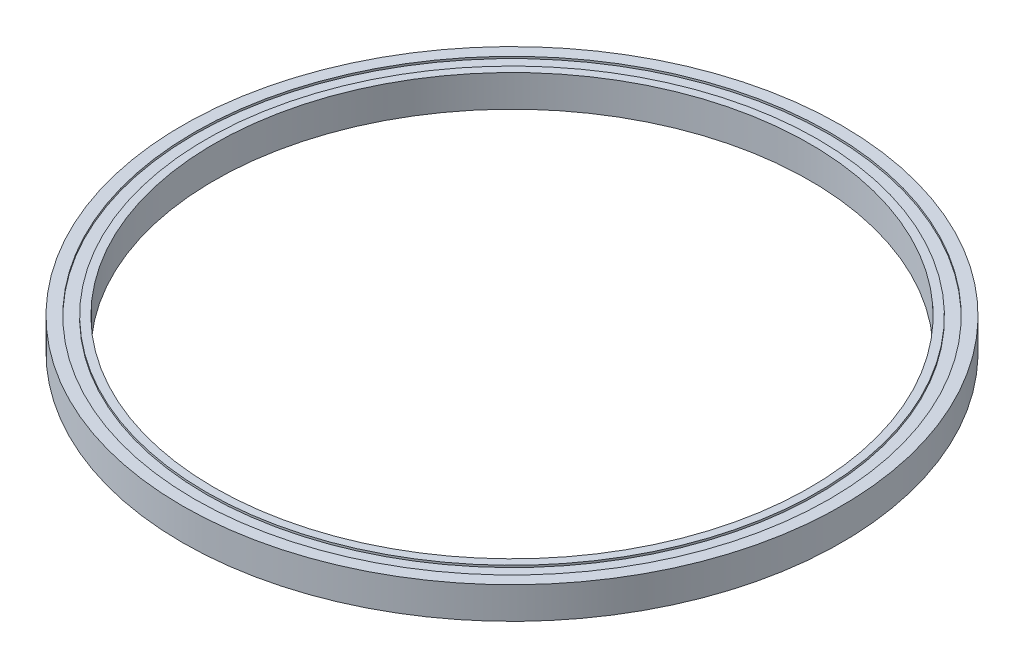
ISO-10303-21;
HEADER;
FILE_DESCRIPTION(('STEP AP214'),'2;1');
FILE_NAME('part.step','',(''),(''),'','','');
FILE_SCHEMA(('AUTOMOTIVE_DESIGN { 1 0 10303 214 1 1 1 1 }'));
ENDSEC;
DATA;
#1=APPLICATION_CONTEXT('core data for automotive mechanical design processes');
#2=APPLICATION_PROTOCOL_DEFINITION('international standard','automotive_design',2000,#1);
#3=PRODUCT_CONTEXT('',#1,'mechanical');
#4=PRODUCT('Part','Part','',(#3));
#5=PRODUCT_RELATED_PRODUCT_CATEGORY('part','',(#4));
#6=PRODUCT_DEFINITION_FORMATION('','',#4);
#7=PRODUCT_DEFINITION_CONTEXT('part definition',#1,'design');
#8=PRODUCT_DEFINITION('design','',#6,#7);
#9=PRODUCT_DEFINITION_SHAPE('','',#8);
#10=(LENGTH_UNIT() NAMED_UNIT(*) SI_UNIT(.MILLI.,.METRE.));
#11=(NAMED_UNIT(*) PLANE_ANGLE_UNIT() SI_UNIT($,.RADIAN.));
#12=(NAMED_UNIT(*) SI_UNIT($,.STERADIAN.) SOLID_ANGLE_UNIT());
#13=UNCERTAINTY_MEASURE_WITH_UNIT(LENGTH_MEASURE(1.E-05),#10,'distance_accuracy_value','');
#14=(GEOMETRIC_REPRESENTATION_CONTEXT(3) GLOBAL_UNCERTAINTY_ASSIGNED_CONTEXT((#13)) GLOBAL_UNIT_ASSIGNED_CONTEXT((#10,
#11,#12)) REPRESENTATION_CONTEXT('',''));
#15=CARTESIAN_POINT('',(0.,0.,0.));
#16=DIRECTION('',(0.,0.,1.));
#17=DIRECTION('',(1.,0.,0.));
#18=AXIS2_PLACEMENT_3D('',#15,#16,#17);
#19=CARTESIAN_POINT('',(0.,0.,0.));
#20=DIRECTION('',(0.,1.,0.));
#21=DIRECTION('',(0.,0.,1.));
#22=AXIS2_PLACEMENT_3D('',#19,#20,#21);
#23=PLANE('',#22);
#24=CARTESIAN_POINT('',(0.,0.,0.));
#25=DIRECTION('',(0.,1.,0.));
#26=DIRECTION('',(0.,0.,1.));
#27=AXIS2_PLACEMENT_3D('',#24,#25,#26);
#28=CIRCLE('',#27,75.);
#29=CARTESIAN_POINT('',(0.,0.,75.));
#30=VERTEX_POINT('',#29);
#31=EDGE_CURVE('E47',#30,#30,#28,.T.);
#32=ORIENTED_EDGE('',*,*,#31,.T.);
#33=EDGE_LOOP('',(#32));
#34=FACE_BOUND('',#33,.T.);
#35=CARTESIAN_POINT('',(0.,0.,0.));
#36=DIRECTION('',(0.,-1.,0.));
#37=DIRECTION('',(0.,0.,-1.));
#38=AXIS2_PLACEMENT_3D('',#35,#36,#37);
#39=CIRCLE('',#38,77.);
#40=CARTESIAN_POINT('',(0.,0.,-77.));
#41=VERTEX_POINT('',#40);
#42=EDGE_CURVE('E71',#41,#41,#39,.T.);
#43=ORIENTED_EDGE('',*,*,#42,.T.);
#44=EDGE_LOOP('',(#43));
#45=FACE_BOUND('',#44,.T.);
#46=ADVANCED_FACE('F34',(#34,#45),#23,.F.);
#47=CARTESIAN_POINT('',(0.,8.,0.));
#48=DIRECTION('',(0.,1.,0.));
#49=DIRECTION('',(0.,0.,1.));
#50=AXIS2_PLACEMENT_3D('',#47,#48,#49);
#51=PLANE('',#50);
#52=CARTESIAN_POINT('',(0.,8.,0.));
#53=DIRECTION('',(0.,1.,0.));
#54=DIRECTION('',(0.,0.,1.));
#55=AXIS2_PLACEMENT_3D('',#52,#53,#54);
#56=CIRCLE('',#55,75.);
#57=CARTESIAN_POINT('',(0.,8.,75.));
#58=VERTEX_POINT('',#57);
#59=EDGE_CURVE('E45',#58,#58,#56,.T.);
#60=ORIENTED_EDGE('',*,*,#59,.F.);
#61=EDGE_LOOP('',(#60));
#62=FACE_BOUND('',#61,.T.);
#63=CARTESIAN_POINT('',(0.,8.,0.));
#64=DIRECTION('',(0.,1.,0.));
#65=DIRECTION('',(0.,0.,1.));
#66=AXIS2_PLACEMENT_3D('',#63,#64,#65);
#67=CIRCLE('',#66,77.);
#68=CARTESIAN_POINT('',(0.,8.,77.));
#69=VERTEX_POINT('',#68);
#70=EDGE_CURVE('E59',#69,#69,#67,.T.);
#71=ORIENTED_EDGE('',*,*,#70,.T.);
#72=EDGE_LOOP('',(#71));
#73=FACE_BOUND('',#72,.T.);
#74=ADVANCED_FACE('F109',(#62,#73),#51,.T.);
#75=CARTESIAN_POINT('',(0.,8.,0.));
#76=DIRECTION('',(0.,1.,0.));
#77=DIRECTION('',(0.,0.,1.));
#78=AXIS2_PLACEMENT_3D('',#75,#76,#77);
#79=CIRCLE('',#78,80.);
#80=CARTESIAN_POINT('',(0.,8.,80.));
#81=VERTEX_POINT('',#80);
#82=EDGE_CURVE('E53',#81,#81,#79,.T.);
#83=ORIENTED_EDGE('',*,*,#82,.F.);
#84=EDGE_LOOP('',(#83));
#85=FACE_BOUND('',#84,.T.);
#86=CARTESIAN_POINT('',(0.,8.,0.));
#87=DIRECTION('',(0.,1.,0.));
#88=DIRECTION('',(0.,0.,1.));
#89=AXIS2_PLACEMENT_3D('',#86,#87,#88);
#90=CIRCLE('',#89,83.);
#91=CARTESIAN_POINT('',(0.,8.,83.));
#92=VERTEX_POINT('',#91);
#93=EDGE_CURVE('E10',#92,#92,#90,.T.);
#94=ORIENTED_EDGE('',*,*,#93,.T.);
#95=EDGE_LOOP('',(#94));
#96=FACE_BOUND('',#95,.T.);
#97=ADVANCED_FACE('F96',(#85,#96),#51,.T.);
#98=CARTESIAN_POINT('',(0.,0.,0.));
#99=DIRECTION('',(0.,-1.,0.));
#100=DIRECTION('',(0.,0.,-1.));
#101=AXIS2_PLACEMENT_3D('',#98,#99,#100);
#102=CIRCLE('',#101,79.5);
#103=CARTESIAN_POINT('',(0.,0.,-79.5));
#104=VERTEX_POINT('',#103);
#105=EDGE_CURVE('E65',#104,#104,#102,.T.);
#106=ORIENTED_EDGE('',*,*,#105,.F.);
#107=EDGE_LOOP('',(#106));
#108=FACE_BOUND('',#107,.T.);
#109=CARTESIAN_POINT('',(0.,0.,0.));
#110=DIRECTION('',(0.,1.,0.));
#111=DIRECTION('',(0.,0.,1.));
#112=AXIS2_PLACEMENT_3D('',#109,#110,#111);
#113=CIRCLE('',#112,83.);
#114=CARTESIAN_POINT('',(0.,0.,83.));
#115=VERTEX_POINT('',#114);
#116=EDGE_CURVE('E38',#115,#115,#113,.T.);
#117=ORIENTED_EDGE('',*,*,#116,.F.);
#118=EDGE_LOOP('',(#117));
#119=FACE_BOUND('',#118,.T.);
#120=ADVANCED_FACE('F93',(#108,#119),#23,.F.);
#121=CARTESIAN_POINT('',(0.,8.,0.));
#122=DIRECTION('',(0.,-1.,0.));
#123=DIRECTION('',(0.,0.,-1.));
#124=AXIS2_PLACEMENT_3D('',#121,#122,#123);
#125=CYLINDRICAL_SURFACE('',#124,83.);
#126=ORIENTED_EDGE('',*,*,#93,.F.);
#127=EDGE_LOOP('',(#126));
#128=FACE_BOUND('',#127,.T.);
#129=ORIENTED_EDGE('',*,*,#116,.T.);
#130=EDGE_LOOP('',(#129));
#131=FACE_BOUND('',#130,.T.);
#132=ADVANCED_FACE('F36',(#128,#131),#125,.T.);
#133=CARTESIAN_POINT('',(0.,8.,0.));
#134=DIRECTION('',(0.,-1.,0.));
#135=DIRECTION('',(0.,0.,-1.));
#136=AXIS2_PLACEMENT_3D('',#133,#134,#135);
#137=CYLINDRICAL_SURFACE('',#136,75.);
#138=ORIENTED_EDGE('',*,*,#59,.T.);
#139=EDGE_LOOP('',(#138));
#140=FACE_BOUND('',#139,.T.);
#141=ORIENTED_EDGE('',*,*,#31,.F.);
#142=EDGE_LOOP('',(#141));
#143=FACE_BOUND('',#142,.T.);
#144=ADVANCED_FACE('F100',(#140,#143),#137,.F.);
#145=CARTESIAN_POINT('',(0.,7.5,0.));
#146=DIRECTION('',(0.,1.,0.));
#147=DIRECTION('',(0.,0.,1.));
#148=AXIS2_PLACEMENT_3D('',#145,#146,#147);
#149=CYLINDRICAL_SURFACE('',#148,80.);
#150=CARTESIAN_POINT('',(0.,7.5,0.));
#151=DIRECTION('',(0.,1.,0.));
#152=DIRECTION('',(0.,0.,1.));
#153=AXIS2_PLACEMENT_3D('',#150,#151,#152);
#154=CIRCLE('',#153,80.);
#155=CARTESIAN_POINT('',(0.,7.5,80.));
#156=VERTEX_POINT('',#155);
#157=EDGE_CURVE('E50',#156,#156,#154,.T.);
#158=ORIENTED_EDGE('',*,*,#157,.F.);
#159=EDGE_LOOP('',(#158));
#160=FACE_BOUND('',#159,.T.);
#161=ORIENTED_EDGE('',*,*,#82,.T.);
#162=EDGE_LOOP('',(#161));
#163=FACE_BOUND('',#162,.T.);
#164=ADVANCED_FACE('F105',(#160,#163),#149,.F.);
#165=CARTESIAN_POINT('',(0.,7.5,0.));
#166=DIRECTION('',(0.,1.,0.));
#167=DIRECTION('',(0.,0.,1.));
#168=AXIS2_PLACEMENT_3D('',#165,#166,#167);
#169=PLANE('',#168);
#170=CARTESIAN_POINT('',(0.,7.5,0.));
#171=DIRECTION('',(0.,1.,0.));
#172=DIRECTION('',(0.,0.,1.));
#173=AXIS2_PLACEMENT_3D('',#170,#171,#172);
#174=CIRCLE('',#173,77.);
#175=CARTESIAN_POINT('',(0.,7.5,77.));
#176=VERTEX_POINT('',#175);
#177=EDGE_CURVE('E56',#176,#176,#174,.T.);
#178=ORIENTED_EDGE('',*,*,#177,.F.);
#179=EDGE_LOOP('',(#178));
#180=FACE_BOUND('',#179,.T.);
#181=ORIENTED_EDGE('',*,*,#157,.T.);
#182=EDGE_LOOP('',(#181));
#183=FACE_BOUND('',#182,.T.);
#184=ADVANCED_FACE('F122',(#180,#183),#169,.T.);
#185=CARTESIAN_POINT('',(0.,7.5,0.));
#186=DIRECTION('',(0.,1.,0.));
#187=DIRECTION('',(0.,0.,1.));
#188=AXIS2_PLACEMENT_3D('',#185,#186,#187);
#189=CYLINDRICAL_SURFACE('',#188,77.);
#190=ORIENTED_EDGE('',*,*,#177,.T.);
#191=EDGE_LOOP('',(#190));
#192=FACE_BOUND('',#191,.T.);
#193=ORIENTED_EDGE('',*,*,#70,.F.);
#194=EDGE_LOOP('',(#193));
#195=FACE_BOUND('',#194,.T.);
#196=ADVANCED_FACE('F89',(#192,#195),#189,.T.);
#197=CARTESIAN_POINT('',(0.,0.5,0.));
#198=DIRECTION('',(0.,-1.,0.));
#199=DIRECTION('',(0.,0.,-1.));
#200=AXIS2_PLACEMENT_3D('',#197,#198,#199);
#201=CYLINDRICAL_SURFACE('',#200,79.5);
#202=CARTESIAN_POINT('',(0.,0.5,0.));
#203=DIRECTION('',(0.,-1.,0.));
#204=DIRECTION('',(0.,0.,-1.));
#205=AXIS2_PLACEMENT_3D('',#202,#203,#204);
#206=CIRCLE('',#205,79.5);
#207=CARTESIAN_POINT('',(0.,0.5,-79.5));
#208=VERTEX_POINT('',#207);
#209=EDGE_CURVE('E62',#208,#208,#206,.T.);
#210=ORIENTED_EDGE('',*,*,#209,.F.);
#211=EDGE_LOOP('',(#210));
#212=FACE_BOUND('',#211,.T.);
#213=ORIENTED_EDGE('',*,*,#105,.T.);
#214=EDGE_LOOP('',(#213));
#215=FACE_BOUND('',#214,.T.);
#216=ADVANCED_FACE('F83',(#212,#215),#201,.F.);
#217=CARTESIAN_POINT('',(0.,0.5,0.));
#218=DIRECTION('',(0.,-1.,0.));
#219=DIRECTION('',(0.,0.,-1.));
#220=AXIS2_PLACEMENT_3D('',#217,#218,#219);
#221=PLANE('',#220);
#222=CARTESIAN_POINT('',(0.,0.5,0.));
#223=DIRECTION('',(0.,-1.,0.));
#224=DIRECTION('',(0.,0.,-1.));
#225=AXIS2_PLACEMENT_3D('',#222,#223,#224);
#226=CIRCLE('',#225,77.);
#227=CARTESIAN_POINT('',(0.,0.5,-77.));
#228=VERTEX_POINT('',#227);
#229=EDGE_CURVE('E68',#228,#228,#226,.T.);
#230=ORIENTED_EDGE('',*,*,#229,.F.);
#231=EDGE_LOOP('',(#230));
#232=FACE_BOUND('',#231,.T.);
#233=ORIENTED_EDGE('',*,*,#209,.T.);
#234=EDGE_LOOP('',(#233));
#235=FACE_BOUND('',#234,.T.);
#236=ADVANCED_FACE('F80',(#232,#235),#221,.T.);
#237=CARTESIAN_POINT('',(0.,0.5,0.));
#238=DIRECTION('',(0.,-1.,0.));
#239=DIRECTION('',(0.,0.,-1.));
#240=AXIS2_PLACEMENT_3D('',#237,#238,#239);
#241=CYLINDRICAL_SURFACE('',#240,77.);
#242=ORIENTED_EDGE('',*,*,#229,.T.);
#243=EDGE_LOOP('',(#242));
#244=FACE_BOUND('',#243,.T.);
#245=ORIENTED_EDGE('',*,*,#42,.F.);
#246=EDGE_LOOP('',(#245));
#247=FACE_BOUND('',#246,.T.);
#248=ADVANCED_FACE('F77',(#244,#247),#241,.T.);
#249=CLOSED_SHELL('',(#46,#74,#97,#120,#132,#144,#164,#184,#196,#216,#236,#248));
#250=MANIFOLD_SOLID_BREP('B2',#249);
#251=ADVANCED_BREP_SHAPE_REPRESENTATION('',(#18,#250),#14);
#252=SHAPE_DEFINITION_REPRESENTATION(#9,#251);
ENDSEC;
END-ISO-10303-21;
